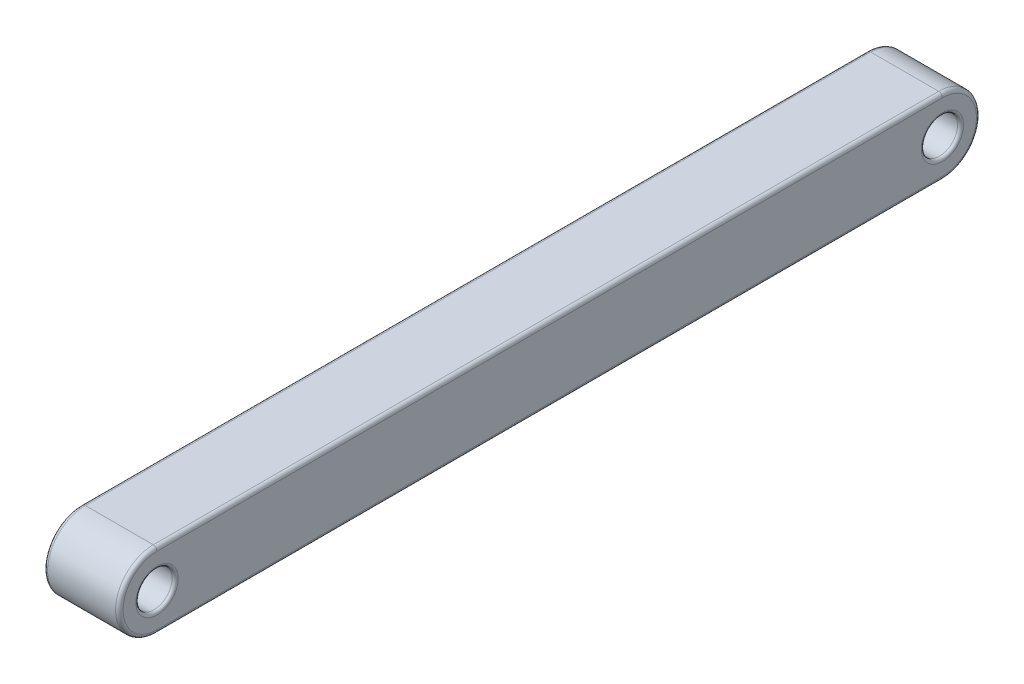
ISO-10303-21;
HEADER;
FILE_DESCRIPTION(('STEP AP214'),'2;1');
FILE_NAME('part.step','',(''),(''),'','','');
FILE_SCHEMA(('AUTOMOTIVE_DESIGN { 1 0 10303 214 1 1 1 1 }'));
ENDSEC;
DATA;
#1=APPLICATION_CONTEXT('core data for automotive mechanical design processes');
#2=APPLICATION_PROTOCOL_DEFINITION('international standard','automotive_design',2000,#1);
#3=PRODUCT_CONTEXT('',#1,'mechanical');
#4=PRODUCT('Part','Part','',(#3));
#5=PRODUCT_RELATED_PRODUCT_CATEGORY('part','',(#4));
#6=PRODUCT_DEFINITION_FORMATION('','',#4);
#7=PRODUCT_DEFINITION_CONTEXT('part definition',#1,'design');
#8=PRODUCT_DEFINITION('design','',#6,#7);
#9=PRODUCT_DEFINITION_SHAPE('','',#8);
#10=(LENGTH_UNIT() NAMED_UNIT(*) SI_UNIT(.MILLI.,.METRE.));
#11=(NAMED_UNIT(*) PLANE_ANGLE_UNIT() SI_UNIT($,.RADIAN.));
#12=(NAMED_UNIT(*) SI_UNIT($,.STERADIAN.) SOLID_ANGLE_UNIT());
#13=UNCERTAINTY_MEASURE_WITH_UNIT(LENGTH_MEASURE(1.E-05),#10,'distance_accuracy_value','');
#14=(GEOMETRIC_REPRESENTATION_CONTEXT(3) GLOBAL_UNCERTAINTY_ASSIGNED_CONTEXT((#13)) GLOBAL_UNIT_ASSIGNED_CONTEXT((#10,
#11,#12)) REPRESENTATION_CONTEXT('',''));
#15=CARTESIAN_POINT('',(0.,0.,0.));
#16=DIRECTION('',(0.,0.,1.));
#17=DIRECTION('',(1.,0.,0.));
#18=AXIS2_PLACEMENT_3D('',#15,#16,#17);
#19=CARTESIAN_POINT('',(2.5,-1.25,-25.));
#20=DIRECTION('',(-1.,0.,0.));
#21=DIRECTION('',(0.,0.,1.));
#22=AXIS2_PLACEMENT_3D('',#19,#20,#21);
#23=CYLINDRICAL_SURFACE('',#22,1.25);
#24=DIRECTION('',(-1.,0.,0.));
#25=VECTOR('',#24,1.);
#26=CARTESIAN_POINT('',(2.5,0.,-25.));
#27=LINE('',#26,#25);
#28=CARTESIAN_POINT('',(2.375,0.,-25.));
#29=VERTEX_POINT('',#28);
#30=CARTESIAN_POINT('',(0.125,0.,-25.));
#31=VERTEX_POINT('',#30);
#32=EDGE_CURVE('E117',#29,#31,#27,.T.);
#33=ORIENTED_EDGE('',*,*,#32,.F.);
#34=CARTESIAN_POINT('',(2.375,-1.25,-25.));
#35=DIRECTION('',(1.,0.,0.));
#36=DIRECTION('',(0.,0.,-1.));
#37=AXIS2_PLACEMENT_3D('',#34,#35,#36);
#38=CIRCLE('',#37,1.25);
#39=CARTESIAN_POINT('',(2.375,-2.50000000000001,-25.));
#40=VERTEX_POINT('',#39);
#41=EDGE_CURVE('E133',#29,#40,#38,.F.);
#42=ORIENTED_EDGE('',*,*,#41,.T.);
#43=DIRECTION('',(-1.,0.,0.));
#44=VECTOR('',#43,1.);
#45=CARTESIAN_POINT('',(2.5,-2.50000000000001,-25.));
#46=LINE('',#45,#44);
#47=CARTESIAN_POINT('',(0.125,-2.50000000000001,-25.));
#48=VERTEX_POINT('',#47);
#49=EDGE_CURVE('E202',#40,#48,#46,.T.);
#50=ORIENTED_EDGE('',*,*,#49,.T.);
#51=CARTESIAN_POINT('',(0.125,-1.25,-25.));
#52=DIRECTION('',(1.,0.,0.));
#53=DIRECTION('',(0.,0.,-1.));
#54=AXIS2_PLACEMENT_3D('',#51,#52,#53);
#55=CIRCLE('',#54,1.25);
#56=EDGE_CURVE('E136',#48,#31,#55,.T.);
#57=ORIENTED_EDGE('',*,*,#56,.T.);
#58=EDGE_LOOP('',(#33,#42,#50,#57));
#59=FACE_BOUND('',#58,.T.);
#60=ADVANCED_FACE('F47',(#59),#23,.T.);
#61=CARTESIAN_POINT('',(2.5,0.,0.));
#62=DIRECTION('',(0.,1.,0.));
#63=DIRECTION('',(0.,0.,1.));
#64=AXIS2_PLACEMENT_3D('',#61,#62,#63);
#65=PLANE('',#64);
#66=DIRECTION('',(-1.,0.,0.));
#67=VECTOR('',#66,1.);
#68=CARTESIAN_POINT('',(2.5,0.,1.));
#69=LINE('',#68,#67);
#70=CARTESIAN_POINT('',(2.375,0.,1.));
#71=VERTEX_POINT('',#70);
#72=CARTESIAN_POINT('',(0.125,0.,1.));
#73=VERTEX_POINT('',#72);
#74=EDGE_CURVE('E119',#71,#73,#69,.T.);
#75=ORIENTED_EDGE('',*,*,#74,.F.);
#76=DIRECTION('',(0.,0.,-1.));
#77=VECTOR('',#76,1.);
#78=CARTESIAN_POINT('',(2.375,0.,0.));
#79=LINE('',#78,#77);
#80=EDGE_CURVE('E114',#71,#29,#79,.T.);
#81=ORIENTED_EDGE('',*,*,#80,.T.);
#82=ORIENTED_EDGE('',*,*,#32,.T.);
#83=DIRECTION('',(0.,0.,-1.));
#84=VECTOR('',#83,1.);
#85=CARTESIAN_POINT('',(0.125,0.,1.));
#86=LINE('',#85,#84);
#87=EDGE_CURVE('E126',#31,#73,#86,.F.);
#88=ORIENTED_EDGE('',*,*,#87,.T.);
#89=EDGE_LOOP('',(#75,#81,#82,#88));
#90=FACE_BOUND('',#89,.T.);
#91=ADVANCED_FACE('F116',(#90),#65,.T.);
#92=CARTESIAN_POINT('',(2.5,-1.25,0.999999999999999));
#93=DIRECTION('',(-1.,0.,0.));
#94=DIRECTION('',(0.,0.,1.));
#95=AXIS2_PLACEMENT_3D('',#92,#93,#94);
#96=CYLINDRICAL_SURFACE('',#95,1.25);
#97=DIRECTION('',(-1.,0.,0.));
#98=VECTOR('',#97,1.);
#99=CARTESIAN_POINT('',(2.5,-2.5,0.999999999999999));
#100=LINE('',#99,#98);
#101=CARTESIAN_POINT('',(2.375,-2.5,0.999999999999999));
#102=VERTEX_POINT('',#101);
#103=CARTESIAN_POINT('',(0.125,-2.5,0.999999999999999));
#104=VERTEX_POINT('',#103);
#105=EDGE_CURVE('E334',#102,#104,#100,.T.);
#106=ORIENTED_EDGE('',*,*,#105,.F.);
#107=CARTESIAN_POINT('',(2.375,-1.25,0.999999999999999));
#108=DIRECTION('',(1.,0.,0.));
#109=DIRECTION('',(0.,0.,-1.));
#110=AXIS2_PLACEMENT_3D('',#107,#108,#109);
#111=CIRCLE('',#110,1.25);
#112=EDGE_CURVE('E173',#102,#71,#111,.F.);
#113=ORIENTED_EDGE('',*,*,#112,.T.);
#114=ORIENTED_EDGE('',*,*,#74,.T.);
#115=CARTESIAN_POINT('',(0.125,-1.25,0.999999999999999));
#116=DIRECTION('',(1.,0.,0.));
#117=DIRECTION('',(0.,0.,-1.));
#118=AXIS2_PLACEMENT_3D('',#115,#116,#117);
#119=CIRCLE('',#118,1.25);
#120=EDGE_CURVE('E125',#73,#104,#119,.T.);
#121=ORIENTED_EDGE('',*,*,#120,.T.);
#122=EDGE_LOOP('',(#106,#113,#114,#121));
#123=FACE_BOUND('',#122,.T.);
#124=ADVANCED_FACE('F258',(#123),#96,.T.);
#125=CARTESIAN_POINT('',(2.5,-1.25,-25.));
#126=DIRECTION('',(-1.,0.,0.));
#127=DIRECTION('',(0.,0.,1.));
#128=AXIS2_PLACEMENT_3D('',#125,#126,#127);
#129=CYLINDRICAL_SURFACE('',#128,0.6);
#130=CARTESIAN_POINT('',(0.0999999999999998,-1.25,-25.));
#131=DIRECTION('',(1.,0.,0.));
#132=DIRECTION('',(0.,0.,-1.));
#133=AXIS2_PLACEMENT_3D('',#130,#131,#132);
#134=CIRCLE('',#133,0.6);
#135=CARTESIAN_POINT('',(0.0999999999999998,-1.25,-25.6));
#136=VERTEX_POINT('',#135);
#137=EDGE_CURVE('E227',#136,#136,#134,.F.);
#138=ORIENTED_EDGE('',*,*,#137,.T.);
#139=EDGE_LOOP('',(#138));
#140=FACE_BOUND('',#139,.T.);
#141=CARTESIAN_POINT('',(2.4,-1.25,-25.));
#142=DIRECTION('',(1.,0.,0.));
#143=DIRECTION('',(0.,0.,-1.));
#144=AXIS2_PLACEMENT_3D('',#141,#142,#143);
#145=CIRCLE('',#144,0.6);
#146=CARTESIAN_POINT('',(2.4,-1.25,-25.6));
#147=VERTEX_POINT('',#146);
#148=EDGE_CURVE('E223',#147,#147,#145,.T.);
#149=ORIENTED_EDGE('',*,*,#148,.T.);
#150=EDGE_LOOP('',(#149));
#151=FACE_BOUND('',#150,.T.);
#152=ADVANCED_FACE('F303',(#140,#151),#129,.F.);
#153=CARTESIAN_POINT('',(2.5,-2.5,0.));
#154=DIRECTION('',(0.,-1.,0.));
#155=DIRECTION('',(0.,0.,-1.));
#156=AXIS2_PLACEMENT_3D('',#153,#154,#155);
#157=PLANE('',#156);
#158=ORIENTED_EDGE('',*,*,#49,.F.);
#159=DIRECTION('',(0.,0.,1.));
#160=VECTOR('',#159,1.);
#161=CARTESIAN_POINT('',(2.375,-2.5,0.));
#162=LINE('',#161,#160);
#163=EDGE_CURVE('E189',#40,#102,#162,.T.);
#164=ORIENTED_EDGE('',*,*,#163,.T.);
#165=ORIENTED_EDGE('',*,*,#105,.T.);
#166=DIRECTION('',(0.,0.,1.));
#167=VECTOR('',#166,1.);
#168=CARTESIAN_POINT('',(0.125,-2.49999999999999,-25.));
#169=LINE('',#168,#167);
#170=EDGE_CURVE('E186',#104,#48,#169,.F.);
#171=ORIENTED_EDGE('',*,*,#170,.T.);
#172=EDGE_LOOP('',(#158,#164,#165,#171));
#173=FACE_BOUND('',#172,.T.);
#174=ADVANCED_FACE('F305',(#173),#157,.T.);
#175=CARTESIAN_POINT('',(2.5,-1.25,0.999999999999999));
#176=DIRECTION('',(-1.,0.,0.));
#177=DIRECTION('',(0.,0.,1.));
#178=AXIS2_PLACEMENT_3D('',#175,#176,#177);
#179=CYLINDRICAL_SURFACE('',#178,0.6);
#180=CARTESIAN_POINT('',(0.0999999999999998,-1.25,0.999999999999999));
#181=DIRECTION('',(1.,0.,0.));
#182=DIRECTION('',(0.,0.,-1.));
#183=AXIS2_PLACEMENT_3D('',#180,#181,#182);
#184=CIRCLE('',#183,0.6);
#185=CARTESIAN_POINT('',(0.0999999999999998,-1.25,0.399999999999999));
#186=VERTEX_POINT('',#185);
#187=EDGE_CURVE('E11',#186,#186,#184,.F.);
#188=ORIENTED_EDGE('',*,*,#187,.T.);
#189=EDGE_LOOP('',(#188));
#190=FACE_BOUND('',#189,.T.);
#191=CARTESIAN_POINT('',(2.4,-1.25,0.999999999999999));
#192=DIRECTION('',(1.,0.,0.));
#193=DIRECTION('',(0.,0.,-1.));
#194=AXIS2_PLACEMENT_3D('',#191,#192,#193);
#195=CIRCLE('',#194,0.6);
#196=CARTESIAN_POINT('',(2.4,-1.25,0.399999999999999));
#197=VERTEX_POINT('',#196);
#198=EDGE_CURVE('E56',#197,#197,#195,.T.);
#199=ORIENTED_EDGE('',*,*,#198,.T.);
#200=EDGE_LOOP('',(#199));
#201=FACE_BOUND('',#200,.T.);
#202=ADVANCED_FACE('F242',(#190,#201),#179,.F.);
#203=CARTESIAN_POINT('',(2.5,0.,0.));
#204=DIRECTION('',(1.,0.,0.));
#205=DIRECTION('',(0.,0.,-1.));
#206=AXIS2_PLACEMENT_3D('',#203,#204,#205);
#207=PLANE('',#206);
#208=CARTESIAN_POINT('',(2.5,-1.25,-25.));
#209=DIRECTION('',(1.,0.,0.));
#210=DIRECTION('',(0.,0.,-1.));
#211=AXIS2_PLACEMENT_3D('',#208,#209,#210);
#212=CIRCLE('',#211,0.7);
#213=CARTESIAN_POINT('',(2.5,-1.25,-25.7));
#214=VERTEX_POINT('',#213);
#215=EDGE_CURVE('E235',#214,#214,#212,.F.);
#216=ORIENTED_EDGE('',*,*,#215,.T.);
#217=EDGE_LOOP('',(#216));
#218=FACE_BOUND('',#217,.T.);
#219=CARTESIAN_POINT('',(2.5,-1.25,0.999999999999999));
#220=DIRECTION('',(1.,0.,0.));
#221=DIRECTION('',(0.,0.,-1.));
#222=AXIS2_PLACEMENT_3D('',#219,#220,#221);
#223=CIRCLE('',#222,0.7);
#224=CARTESIAN_POINT('',(2.5,-1.25,0.299999999999999));
#225=VERTEX_POINT('',#224);
#226=EDGE_CURVE('E231',#225,#225,#223,.F.);
#227=ORIENTED_EDGE('',*,*,#226,.T.);
#228=EDGE_LOOP('',(#227));
#229=FACE_BOUND('',#228,.T.);
#230=DIRECTION('',(0.,0.,1.));
#231=VECTOR('',#230,1.);
#232=CARTESIAN_POINT('',(2.5,-2.375,0.));
#233=LINE('',#232,#231);
#234=CARTESIAN_POINT('',(2.5,-2.375,0.999999999999999));
#235=VERTEX_POINT('',#234);
#236=CARTESIAN_POINT('',(2.5,-2.37499999999999,-25.));
#237=VERTEX_POINT('',#236);
#238=EDGE_CURVE('E154',#235,#237,#233,.F.);
#239=ORIENTED_EDGE('',*,*,#238,.T.);
#240=CARTESIAN_POINT('',(2.5,-1.25,-25.));
#241=DIRECTION('',(1.,0.,0.));
#242=DIRECTION('',(0.,0.,-1.));
#243=AXIS2_PLACEMENT_3D('',#240,#241,#242);
#244=CIRCLE('',#243,1.125);
#245=CARTESIAN_POINT('',(2.5,-0.125,-25.));
#246=VERTEX_POINT('',#245);
#247=EDGE_CURVE('E166',#237,#246,#244,.T.);
#248=ORIENTED_EDGE('',*,*,#247,.T.);
#249=DIRECTION('',(0.,0.,-1.));
#250=VECTOR('',#249,1.);
#251=CARTESIAN_POINT('',(2.5,-0.124999999999984,0.));
#252=LINE('',#251,#250);
#253=CARTESIAN_POINT('',(2.5,-0.125,1.));
#254=VERTEX_POINT('',#253);
#255=EDGE_CURVE('E142',#246,#254,#252,.F.);
#256=ORIENTED_EDGE('',*,*,#255,.T.);
#257=CARTESIAN_POINT('',(2.5,-1.25,0.999999999999999));
#258=DIRECTION('',(1.,0.,0.));
#259=DIRECTION('',(0.,0.,-1.));
#260=AXIS2_PLACEMENT_3D('',#257,#258,#259);
#261=CIRCLE('',#260,1.125);
#262=EDGE_CURVE('E158',#254,#235,#261,.T.);
#263=ORIENTED_EDGE('',*,*,#262,.T.);
#264=EDGE_LOOP('',(#239,#248,#256,#263));
#265=FACE_BOUND('',#264,.T.);
#266=ADVANCED_FACE('F318',(#218,#229,#265),#207,.T.);
#267=CARTESIAN_POINT('',(0.,0.,0.));
#268=DIRECTION('',(1.,0.,0.));
#269=DIRECTION('',(0.,0.,-1.));
#270=AXIS2_PLACEMENT_3D('',#267,#268,#269);
#271=PLANE('',#270);
#272=CARTESIAN_POINT('',(0.,-1.25,-25.));
#273=DIRECTION('',(1.,0.,0.));
#274=DIRECTION('',(0.,0.,-1.));
#275=AXIS2_PLACEMENT_3D('',#272,#273,#274);
#276=CIRCLE('',#275,0.7);
#277=CARTESIAN_POINT('',(0.,-1.25,-25.7));
#278=VERTEX_POINT('',#277);
#279=EDGE_CURVE('E219',#278,#278,#276,.T.);
#280=ORIENTED_EDGE('',*,*,#279,.T.);
#281=EDGE_LOOP('',(#280));
#282=FACE_BOUND('',#281,.T.);
#283=CARTESIAN_POINT('',(0.,-1.25,0.999999999999999));
#284=DIRECTION('',(1.,0.,0.));
#285=DIRECTION('',(0.,0.,-1.));
#286=AXIS2_PLACEMENT_3D('',#283,#284,#285);
#287=CIRCLE('',#286,0.7);
#288=CARTESIAN_POINT('',(0.,-1.25,0.299999999999999));
#289=VERTEX_POINT('',#288);
#290=EDGE_CURVE('E192',#289,#289,#287,.T.);
#291=ORIENTED_EDGE('',*,*,#290,.T.);
#292=EDGE_LOOP('',(#291));
#293=FACE_BOUND('',#292,.T.);
#294=DIRECTION('',(0.,0.,-1.));
#295=VECTOR('',#294,1.);
#296=CARTESIAN_POINT('',(0.,-0.125,-25.));
#297=LINE('',#296,#295);
#298=CARTESIAN_POINT('',(0.,-0.125,1.));
#299=VERTEX_POINT('',#298);
#300=CARTESIAN_POINT('',(0.,-0.125,-25.));
#301=VERTEX_POINT('',#300);
#302=EDGE_CURVE('E63',#299,#301,#297,.T.);
#303=ORIENTED_EDGE('',*,*,#302,.T.);
#304=CARTESIAN_POINT('',(0.,-1.25,-25.));
#305=DIRECTION('',(1.,0.,0.));
#306=DIRECTION('',(0.,0.,-1.));
#307=AXIS2_PLACEMENT_3D('',#304,#305,#306);
#308=CIRCLE('',#307,1.125);
#309=CARTESIAN_POINT('',(0.,-2.37499999999999,-25.));
#310=VERTEX_POINT('',#309);
#311=EDGE_CURVE('E183',#301,#310,#308,.F.);
#312=ORIENTED_EDGE('',*,*,#311,.T.);
#313=DIRECTION('',(0.,0.,1.));
#314=VECTOR('',#313,1.);
#315=CARTESIAN_POINT('',(0.,-2.375,0.999999999999999));
#316=LINE('',#315,#314);
#317=CARTESIAN_POINT('',(0.,-2.375,0.999999999999999));
#318=VERTEX_POINT('',#317);
#319=EDGE_CURVE('E176',#310,#318,#316,.T.);
#320=ORIENTED_EDGE('',*,*,#319,.T.);
#321=CARTESIAN_POINT('',(0.,-1.25,0.999999999999999));
#322=DIRECTION('',(1.,0.,0.));
#323=DIRECTION('',(0.,0.,-1.));
#324=AXIS2_PLACEMENT_3D('',#321,#322,#323);
#325=CIRCLE('',#324,1.125);
#326=EDGE_CURVE('E68',#318,#299,#325,.F.);
#327=ORIENTED_EDGE('',*,*,#326,.T.);
#328=EDGE_LOOP('',(#303,#312,#320,#327));
#329=FACE_BOUND('',#328,.T.);
#330=ADVANCED_FACE('F274',(#282,#293,#329),#271,.F.);
#331=CARTESIAN_POINT('',(2.375,-1.25,0.999999999999999));
#332=DIRECTION('',(1.,0.,0.));
#333=DIRECTION('',(0.,0.,-1.));
#334=AXIS2_PLACEMENT_3D('',#331,#332,#333);
#335=TOROIDAL_SURFACE('',#334,1.125,0.125);
#336=CARTESIAN_POINT('',(2.375,-2.375,0.999999999999999));
#337=DIRECTION('',(0.,0.,-1.));
#338=DIRECTION('',(-1.,0.,0.));
#339=AXIS2_PLACEMENT_3D('',#336,#337,#338);
#340=CIRCLE('',#339,0.125);
#341=EDGE_CURVE('E147',#235,#102,#340,.T.);
#342=ORIENTED_EDGE('',*,*,#341,.F.);
#343=ORIENTED_EDGE('',*,*,#262,.F.);
#344=CARTESIAN_POINT('',(2.375,-0.125,1.));
#345=DIRECTION('',(0.,0.,-1.));
#346=DIRECTION('',(-1.,0.,0.));
#347=AXIS2_PLACEMENT_3D('',#344,#345,#346);
#348=CIRCLE('',#347,0.125);
#349=EDGE_CURVE('E199',#71,#254,#348,.T.);
#350=ORIENTED_EDGE('',*,*,#349,.F.);
#351=ORIENTED_EDGE('',*,*,#112,.F.);
#352=EDGE_LOOP('',(#342,#343,#350,#351));
#353=FACE_BOUND('',#352,.T.);
#354=ADVANCED_FACE('F271',(#353),#335,.T.);
#355=CARTESIAN_POINT('',(2.375,-0.124999999999984,0.));
#356=DIRECTION('',(0.,0.,-1.));
#357=DIRECTION('',(0.,1.,0.));
#358=AXIS2_PLACEMENT_3D('',#355,#356,#357);
#359=CYLINDRICAL_SURFACE('',#358,0.125);
#360=ORIENTED_EDGE('',*,*,#349,.T.);
#361=ORIENTED_EDGE('',*,*,#255,.F.);
#362=CARTESIAN_POINT('',(2.375,-0.125,-25.));
#363=DIRECTION('',(0.,0.,-1.));
#364=DIRECTION('',(-1.,0.,0.));
#365=AXIS2_PLACEMENT_3D('',#362,#363,#364);
#366=CIRCLE('',#365,0.125);
#367=EDGE_CURVE('E140',#29,#246,#366,.T.);
#368=ORIENTED_EDGE('',*,*,#367,.F.);
#369=ORIENTED_EDGE('',*,*,#80,.F.);
#370=EDGE_LOOP('',(#360,#361,#368,#369));
#371=FACE_BOUND('',#370,.T.);
#372=ADVANCED_FACE('F141',(#371),#359,.T.);
#373=CARTESIAN_POINT('',(2.375,-2.375,0.));
#374=DIRECTION('',(0.,0.,1.));
#375=DIRECTION('',(0.,-1.,0.));
#376=AXIS2_PLACEMENT_3D('',#373,#374,#375);
#377=CYLINDRICAL_SURFACE('',#376,0.125);
#378=ORIENTED_EDGE('',*,*,#341,.T.);
#379=ORIENTED_EDGE('',*,*,#163,.F.);
#380=CARTESIAN_POINT('',(2.375,-2.37499999999999,-25.));
#381=DIRECTION('',(0.,0.,-1.));
#382=DIRECTION('',(-1.,0.,0.));
#383=AXIS2_PLACEMENT_3D('',#380,#381,#382);
#384=CIRCLE('',#383,0.125);
#385=EDGE_CURVE('E148',#237,#40,#384,.T.);
#386=ORIENTED_EDGE('',*,*,#385,.F.);
#387=ORIENTED_EDGE('',*,*,#238,.F.);
#388=EDGE_LOOP('',(#378,#379,#386,#387));
#389=FACE_BOUND('',#388,.T.);
#390=ADVANCED_FACE('F265',(#389),#377,.T.);
#391=CARTESIAN_POINT('',(2.375,-1.25,-25.));
#392=DIRECTION('',(1.,0.,0.));
#393=DIRECTION('',(0.,0.,-1.));
#394=AXIS2_PLACEMENT_3D('',#391,#392,#393);
#395=TOROIDAL_SURFACE('',#394,1.125,0.125);
#396=ORIENTED_EDGE('',*,*,#367,.T.);
#397=ORIENTED_EDGE('',*,*,#247,.F.);
#398=ORIENTED_EDGE('',*,*,#385,.T.);
#399=ORIENTED_EDGE('',*,*,#41,.F.);
#400=EDGE_LOOP('',(#396,#397,#398,#399));
#401=FACE_BOUND('',#400,.T.);
#402=ADVANCED_FACE('F150',(#401),#395,.T.);
#403=CARTESIAN_POINT('',(0.125,-1.25,0.999999999999999));
#404=DIRECTION('',(1.,0.,0.));
#405=DIRECTION('',(0.,0.,-1.));
#406=AXIS2_PLACEMENT_3D('',#403,#404,#405);
#407=TOROIDAL_SURFACE('',#406,1.125,0.125);
#408=CARTESIAN_POINT('',(0.125,-2.375,0.999999999999999));
#409=DIRECTION('',(0.,0.,-1.));
#410=DIRECTION('',(-1.,0.,0.));
#411=AXIS2_PLACEMENT_3D('',#408,#409,#410);
#412=CIRCLE('',#411,0.125);
#413=EDGE_CURVE('E209',#104,#318,#412,.T.);
#414=ORIENTED_EDGE('',*,*,#413,.F.);
#415=ORIENTED_EDGE('',*,*,#120,.F.);
#416=CARTESIAN_POINT('',(0.125,-0.125,1.));
#417=DIRECTION('',(0.,0.,-1.));
#418=DIRECTION('',(-1.,0.,0.));
#419=AXIS2_PLACEMENT_3D('',#416,#417,#418);
#420=CIRCLE('',#419,0.125);
#421=EDGE_CURVE('E194',#299,#73,#420,.T.);
#422=ORIENTED_EDGE('',*,*,#421,.F.);
#423=ORIENTED_EDGE('',*,*,#326,.F.);
#424=EDGE_LOOP('',(#414,#415,#422,#423));
#425=FACE_BOUND('',#424,.T.);
#426=ADVANCED_FACE('F264',(#425),#407,.T.);
#427=CARTESIAN_POINT('',(0.125,-0.124999999999984,0.));
#428=DIRECTION('',(0.,0.,1.));
#429=DIRECTION('',(0.,-1.,0.));
#430=AXIS2_PLACEMENT_3D('',#427,#428,#429);
#431=CYLINDRICAL_SURFACE('',#430,0.125);
#432=ORIENTED_EDGE('',*,*,#421,.T.);
#433=ORIENTED_EDGE('',*,*,#87,.F.);
#434=CARTESIAN_POINT('',(0.125,-0.125,-25.));
#435=DIRECTION('',(0.,0.,-1.));
#436=DIRECTION('',(-1.,0.,0.));
#437=AXIS2_PLACEMENT_3D('',#434,#435,#436);
#438=CIRCLE('',#437,0.125);
#439=EDGE_CURVE('E206',#301,#31,#438,.T.);
#440=ORIENTED_EDGE('',*,*,#439,.F.);
#441=ORIENTED_EDGE('',*,*,#302,.F.);
#442=EDGE_LOOP('',(#432,#433,#440,#441));
#443=FACE_BOUND('',#442,.T.);
#444=ADVANCED_FACE('F284',(#443),#431,.T.);
#445=CARTESIAN_POINT('',(0.125,-2.375,0.));
#446=DIRECTION('',(0.,0.,-1.));
#447=DIRECTION('',(0.,1.,0.));
#448=AXIS2_PLACEMENT_3D('',#445,#446,#447);
#449=CYLINDRICAL_SURFACE('',#448,0.125);
#450=ORIENTED_EDGE('',*,*,#413,.T.);
#451=ORIENTED_EDGE('',*,*,#319,.F.);
#452=CARTESIAN_POINT('',(0.125,-2.37499999999999,-25.));
#453=DIRECTION('',(0.,0.,-1.));
#454=DIRECTION('',(-1.,0.,0.));
#455=AXIS2_PLACEMENT_3D('',#452,#453,#454);
#456=CIRCLE('',#455,0.125);
#457=EDGE_CURVE('E203',#48,#310,#456,.T.);
#458=ORIENTED_EDGE('',*,*,#457,.F.);
#459=ORIENTED_EDGE('',*,*,#170,.F.);
#460=EDGE_LOOP('',(#450,#451,#458,#459));
#461=FACE_BOUND('',#460,.T.);
#462=ADVANCED_FACE('F280',(#461),#449,.T.);
#463=CARTESIAN_POINT('',(0.125,-1.25,-25.));
#464=DIRECTION('',(1.,0.,0.));
#465=DIRECTION('',(0.,0.,-1.));
#466=AXIS2_PLACEMENT_3D('',#463,#464,#465);
#467=TOROIDAL_SURFACE('',#466,1.125,0.125);
#468=ORIENTED_EDGE('',*,*,#439,.T.);
#469=ORIENTED_EDGE('',*,*,#56,.F.);
#470=ORIENTED_EDGE('',*,*,#457,.T.);
#471=ORIENTED_EDGE('',*,*,#311,.F.);
#472=EDGE_LOOP('',(#468,#469,#470,#471));
#473=FACE_BOUND('',#472,.T.);
#474=ADVANCED_FACE('F276',(#473),#467,.T.);
#475=CARTESIAN_POINT('',(0.0999999999999998,-1.25,-25.));
#476=DIRECTION('',(1.,0.,0.));
#477=DIRECTION('',(0.,0.,-1.));
#478=AXIS2_PLACEMENT_3D('',#475,#476,#477);
#479=TOROIDAL_SURFACE('',#478,0.7,0.1);
#480=ORIENTED_EDGE('',*,*,#137,.F.);
#481=EDGE_LOOP('',(#480));
#482=FACE_BOUND('',#481,.T.);
#483=ORIENTED_EDGE('',*,*,#279,.F.);
#484=EDGE_LOOP('',(#483));
#485=FACE_BOUND('',#484,.T.);
#486=ADVANCED_FACE('F279',(#482,#485),#479,.T.);
#487=CARTESIAN_POINT('',(2.4,-1.25,-25.));
#488=DIRECTION('',(1.,0.,0.));
#489=DIRECTION('',(0.,0.,-1.));
#490=AXIS2_PLACEMENT_3D('',#487,#488,#489);
#491=TOROIDAL_SURFACE('',#490,0.7,0.1);
#492=ORIENTED_EDGE('',*,*,#215,.F.);
#493=EDGE_LOOP('',(#492));
#494=FACE_BOUND('',#493,.T.);
#495=ORIENTED_EDGE('',*,*,#148,.F.);
#496=EDGE_LOOP('',(#495));
#497=FACE_BOUND('',#496,.T.);
#498=ADVANCED_FACE('F250',(#494,#497),#491,.T.);
#499=CARTESIAN_POINT('',(0.0999999999999998,-1.25,0.999999999999999));
#500=DIRECTION('',(1.,0.,0.));
#501=DIRECTION('',(0.,0.,-1.));
#502=AXIS2_PLACEMENT_3D('',#499,#500,#501);
#503=TOROIDAL_SURFACE('',#502,0.7,0.1);
#504=ORIENTED_EDGE('',*,*,#187,.F.);
#505=EDGE_LOOP('',(#504));
#506=FACE_BOUND('',#505,.T.);
#507=ORIENTED_EDGE('',*,*,#290,.F.);
#508=EDGE_LOOP('',(#507));
#509=FACE_BOUND('',#508,.T.);
#510=ADVANCED_FACE('F245',(#506,#509),#503,.T.);
#511=CARTESIAN_POINT('',(2.4,-1.25,0.999999999999999));
#512=DIRECTION('',(1.,0.,0.));
#513=DIRECTION('',(0.,0.,-1.));
#514=AXIS2_PLACEMENT_3D('',#511,#512,#513);
#515=TOROIDAL_SURFACE('',#514,0.7,0.1);
#516=ORIENTED_EDGE('',*,*,#226,.F.);
#517=EDGE_LOOP('',(#516));
#518=FACE_BOUND('',#517,.T.);
#519=ORIENTED_EDGE('',*,*,#198,.F.);
#520=EDGE_LOOP('',(#519));
#521=FACE_BOUND('',#520,.T.);
#522=ADVANCED_FACE('F49',(#518,#521),#515,.T.);
#523=CLOSED_SHELL('',(#60,#91,#124,#152,#174,#202,#266,#330,#354,#372,#390,#402,#426,#444,#462,
#474,#486,#498,#510,#522));
#524=MANIFOLD_SOLID_BREP('B2',#523);
#525=ADVANCED_BREP_SHAPE_REPRESENTATION('',(#18,#524),#14);
#526=SHAPE_DEFINITION_REPRESENTATION(#9,#525);
ENDSEC;
END-ISO-10303-21;
